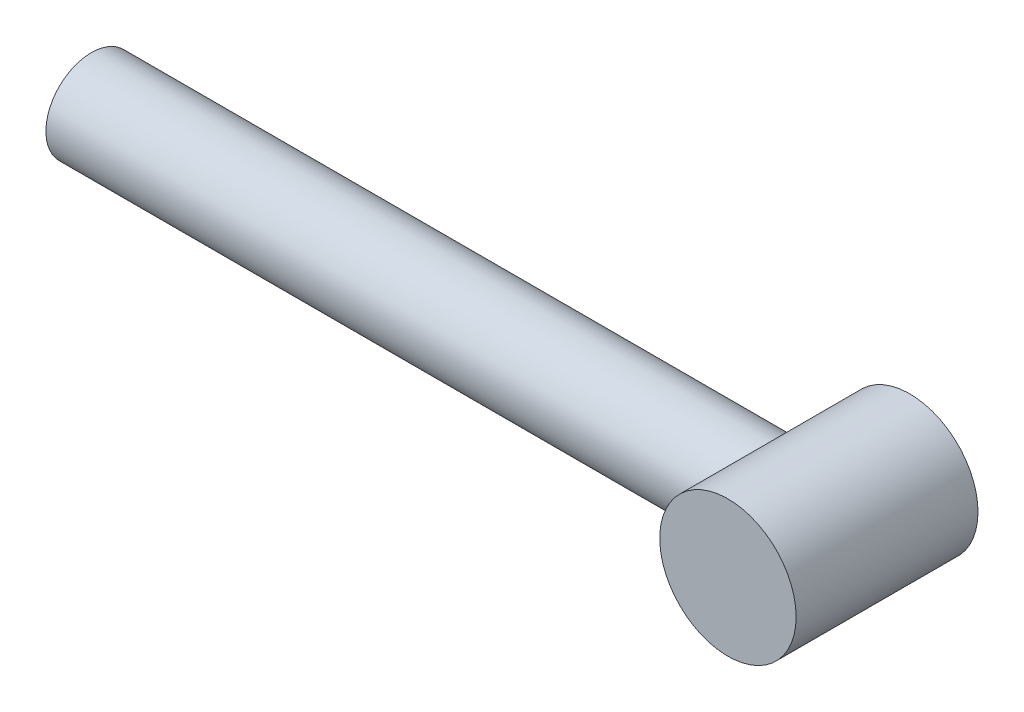
ISO-10303-21;
HEADER;
FILE_DESCRIPTION(('STEP AP214'),'2;1');
FILE_NAME('part.step','',(''),(''),'','','');
FILE_SCHEMA(('AUTOMOTIVE_DESIGN { 1 0 10303 214 1 1 1 1 }'));
ENDSEC;
DATA;
#1=APPLICATION_CONTEXT('core data for automotive mechanical design processes');
#2=APPLICATION_PROTOCOL_DEFINITION('international standard','automotive_design',2000,#1);
#3=PRODUCT_CONTEXT('',#1,'mechanical');
#4=PRODUCT('Part','Part','',(#3));
#5=PRODUCT_RELATED_PRODUCT_CATEGORY('part','',(#4));
#6=PRODUCT_DEFINITION_FORMATION('','',#4);
#7=PRODUCT_DEFINITION_CONTEXT('part definition',#1,'design');
#8=PRODUCT_DEFINITION('design','',#6,#7);
#9=PRODUCT_DEFINITION_SHAPE('','',#8);
#10=(LENGTH_UNIT() NAMED_UNIT(*) SI_UNIT(.MILLI.,.METRE.));
#11=(NAMED_UNIT(*) PLANE_ANGLE_UNIT() SI_UNIT($,.RADIAN.));
#12=(NAMED_UNIT(*) SI_UNIT($,.STERADIAN.) SOLID_ANGLE_UNIT());
#13=UNCERTAINTY_MEASURE_WITH_UNIT(LENGTH_MEASURE(1.E-05),#10,'distance_accuracy_value','');
#14=(GEOMETRIC_REPRESENTATION_CONTEXT(3) GLOBAL_UNCERTAINTY_ASSIGNED_CONTEXT((#13)) GLOBAL_UNIT_ASSIGNED_CONTEXT((#10,
#11,#12)) REPRESENTATION_CONTEXT('',''));
#15=CARTESIAN_POINT('',(0.,0.,0.));
#16=DIRECTION('',(0.,0.,1.));
#17=DIRECTION('',(1.,0.,0.));
#18=AXIS2_PLACEMENT_3D('',#15,#16,#17);
#19=CARTESIAN_POINT('',(0.,0.,3.175));
#20=DIRECTION('',(0.,0.,-1.));
#21=DIRECTION('',(-1.,0.,0.));
#22=AXIS2_PLACEMENT_3D('',#19,#20,#21);
#23=CYLINDRICAL_SURFACE('',#22,2.38125);
#24=CARTESIAN_POINT('',(-2.38125,0.,1.5875));
#25=CARTESIAN_POINT('',(-2.38125033055591,-0.0797597438552867,1.58750043627078));
#26=CARTESIAN_POINT('',(-2.37720824685502,-0.15951921291174,1.58145641134782));
#27=CARTESIAN_POINT('',(-2.36144317861398,-0.316494364812647,1.55765748911613));
#28=CARTESIAN_POINT('',(-2.34971654755105,-0.393708821701787,1.53989703202088));
#29=CARTESIAN_POINT('',(-2.31973820408737,-0.54309351935931,1.49375199937341));
#30=CARTESIAN_POINT('',(-2.30151706235319,-0.615285530171934,1.4654171701187));
#31=CARTESIAN_POINT('',(-2.26001371940218,-0.753598387229075,1.39933095540325));
#32=CARTESIAN_POINT('',(-2.23673078343123,-0.819718350090174,1.36157820274893));
#33=CARTESIAN_POINT('',(-2.18461692687309,-0.950344731236274,1.2742410559646));
#34=CARTESIAN_POINT('',(-2.15548287453585,-1.01423811745941,1.22392451053533));
#35=CARTESIAN_POINT('',(-2.09535961010001,-1.13325913547486,1.11463927387736));
#36=CARTESIAN_POINT('',(-2.06436777845735,-1.18837396900461,1.05565818694129));
#37=CARTESIAN_POINT('',(-1.99809310088793,-1.29716448835487,0.919914683207441));
#38=CARTESIAN_POINT('',(-1.96290460175628,-1.34924154175434,0.841815012769766));
#39=CARTESIAN_POINT('',(-1.89773041961298,-1.4394684588,0.675986568993059));
#40=CARTESIAN_POINT('',(-1.86773578664006,-1.47764240782283,0.588274793759543));
#41=CARTESIAN_POINT('',(-1.82543661646667,-1.52935015290331,0.431235410846607));
#42=CARTESIAN_POINT('',(-1.81052492139621,-1.54681592493588,0.363911790531406));
#43=CARTESIAN_POINT('',(-1.78798513417285,-1.57282052867018,0.226421549361249));
#44=CARTESIAN_POINT('',(-1.78034448940571,-1.58137474754971,0.156260046948436));
#45=CARTESIAN_POINT('',(-1.77352805701482,-1.58901895287124,0.0147043942829339));
#46=CARTESIAN_POINT('',(-1.77438687031172,-1.58807025315877,-0.0566936123643867));
#47=CARTESIAN_POINT('',(-1.78450696789608,-1.57668580183258,-0.198147760216386));
#48=CARTESIAN_POINT('',(-1.79377537076364,-1.56624201276591,-0.2682027132384));
#49=CARTESIAN_POINT('',(-1.81869703880818,-1.53721589160333,-0.402008221919831));
#50=CARTESIAN_POINT('',(-1.8340505636218,-1.51901295988044,-0.465900560388921));
#51=CARTESIAN_POINT('',(-1.86935763198854,-1.47534406624383,-0.589775054724507));
#52=CARTESIAN_POINT('',(-1.88931268879766,-1.44987571437529,-0.649755915923451));
#53=CARTESIAN_POINT('',(-1.93646580896011,-1.38647343624608,-0.77710140750531));
#54=CARTESIAN_POINT('',(-1.96431152292655,-1.3470576653596,-0.843486295774318));
#55=CARTESIAN_POINT('',(-2.02161408164442,-1.25943487370924,-0.969473069768398));
#56=CARTESIAN_POINT('',(-2.05107288176378,-1.21121701025154,-1.02906644077894));
#57=CARTESIAN_POINT('',(-2.11568779081077,-1.09522549966354,-1.15295564565821));
#58=CARTESIAN_POINT('',(-2.15070328613601,-1.02547688510464,-1.21549640116468));
#59=CARTESIAN_POINT('',(-2.21629367411347,-0.874718849291673,-1.32809971751721));
#60=CARTESIAN_POINT('',(-2.2468727101014,-0.793720075109322,-1.37817395291291));
#61=CARTESIAN_POINT('',(-2.29509164495113,-0.638855900253642,-1.4553229391613));
#62=CARTESIAN_POINT('',(-2.31409288549715,-0.566703879425322,-1.48498191965146));
#63=CARTESIAN_POINT('',(-2.3455925198089,-0.417541109874921,-1.53360828471396));
#64=CARTESIAN_POINT('',(-2.35809640876353,-0.340534528957865,-1.55258470528588));
#65=CARTESIAN_POINT('',(-2.3755023146185,-0.183344703455194,-1.57889667490798));
#66=CARTESIAN_POINT('',(-2.38037149703536,-0.103149250722658,-1.58618194711983));
#67=CARTESIAN_POINT('',(-2.38190972503616,0.0575004560152105,-1.58848987654617));
#68=CARTESIAN_POINT('',(-2.37857934387355,0.137954691535611,-1.58351339101294));
#69=CARTESIAN_POINT('',(-2.36457799105509,0.290874225530882,-1.56239840589772));
#70=CARTESIAN_POINT('',(-2.3544390807224,0.363503721714113,-1.5470685199068));
#71=CARTESIAN_POINT('',(-2.32821519119841,0.504917386489242,-1.50685842422729));
#72=CARTESIAN_POINT('',(-2.31212926374173,0.573700939822084,-1.48197669145073));
#73=CARTESIAN_POINT('',(-2.27406479820018,0.710140145682384,-1.4218822392206));
#74=CARTESIAN_POINT('',(-2.25178834420279,0.777475096551188,-1.38613502769753));
#75=CARTESIAN_POINT('',(-2.20346472891637,0.905417150266098,-1.30616857610515));
#76=CARTESIAN_POINT('',(-2.17741524133128,0.966020061384469,-1.26194410382759));
#77=CARTESIAN_POINT('',(-2.1189517140616,1.08890947351594,-1.15839250464998));
#78=CARTESIAN_POINT('',(-2.08618261960131,1.14994680133342,-1.0977830310654));
#79=CARTESIAN_POINT('',(-2.02065868636979,1.26153837155125,-0.96749280247154));
#80=CARTESIAN_POINT('',(-1.98790387294164,1.31208536840426,-0.897805831458418));
#81=CARTESIAN_POINT('',(-1.92833370182898,1.39799041386017,-0.756330709865302));
#82=CARTESIAN_POINT('',(-1.9012503013915,1.43427161174443,-0.685218948439372));
#83=CARTESIAN_POINT('',(-1.8529218582376,1.49618869656335,-0.536676082122867));
#84=CARTESIAN_POINT('',(-1.83166633070546,1.52184374385238,-0.459256655220705));
#85=CARTESIAN_POINT('',(-1.80128233994965,1.55762200750613,-0.313876938288642));
#86=CARTESIAN_POINT('',(-1.79066029679373,1.56970886818191,-0.246719875910917));
#87=CARTESIAN_POINT('',(-1.77704326485478,1.58511244701677,-0.110669957953533));
#88=CARTESIAN_POINT('',(-1.77403999194829,1.5884386910147,-0.0417790700330258));
#89=CARTESIAN_POINT('',(-1.77612834662798,1.5861023807263,0.095760426274434));
#90=CARTESIAN_POINT('',(-1.78122476739049,1.58043450396928,0.164408867090418));
#91=CARTESIAN_POINT('',(-1.79872046595271,1.56048866547142,0.299516425772366));
#92=CARTESIAN_POINT('',(-1.81112948612544,1.54619921684304,0.365972497848057));
#93=CARTESIAN_POINT('',(-1.84568182349436,1.50489472053136,0.512533254269478));
#94=CARTESIAN_POINT('',(-1.86953789775142,1.47550336035045,0.591556247148763));
#95=CARTESIAN_POINT('',(-1.92263840390039,1.405608427,0.742542674792462));
#96=CARTESIAN_POINT('',(-1.95189038188818,1.36508925245875,0.814496004030902));
#97=CARTESIAN_POINT('',(-2.01308641845588,1.27316135190652,0.951929997914382));
#98=CARTESIAN_POINT('',(-2.04506978742622,1.22156783478379,1.01726900417954));
#99=CARTESIAN_POINT('',(-2.10842464345663,1.10864465874681,1.13928721711723));
#100=CARTESIAN_POINT('',(-2.13979593973214,1.04731201689188,1.19596376014193));
#101=CARTESIAN_POINT('',(-2.2037004437149,0.906031755504732,1.30707773279533));
#102=CARTESIAN_POINT('',(-2.2357540807593,0.824675825209875,1.36002604564154));
#103=CARTESIAN_POINT('',(-2.29217272287615,0.651564416143403,1.45090616335308));
#104=CARTESIAN_POINT('',(-2.31654979797171,0.559825574569019,1.48886156604151));
#105=CARTESIAN_POINT('',(-2.35030680589286,0.390076586682124,1.5407914464175));
#106=CARTESIAN_POINT('',(-2.36181487542842,0.313541033173476,1.55821938728453));
#107=CARTESIAN_POINT('',(-2.37728347362596,0.158002297044008,1.58156912582711));
#108=CARTESIAN_POINT('',(-2.38124967258856,0.0790010137242316,1.58749956787933));
#109=CARTESIAN_POINT('',(-2.38125,0.,1.5875));
#110=B_SPLINE_CURVE_WITH_KNOTS('',3,(#24,#25,#26,#27,#28,#29,#30,#31,#32,#33,#34,#35,#36,#37,
#38,#39,#40,#41,#42,#43,#44,#45,#46,#47,#48,#49,#50,#51,#52,#53,#54,#55,#56,#57,#58,#59,#60,#61,
#62,#63,#64,#65,#66,#67,#68,#69,#70,#71,#72,#73,#74,#75,#76,#77,#78,#79,#80,#81,#82,#83,#84,#85,
#86,#87,#88,#89,#90,#91,#92,#93,#94,#95,#96,#97,#98,#99,#100,#101,#102,#103,#104,#105,#106,#107,
#108,#109),.UNSPECIFIED.,.T.,.F.,(4,2,2,2,2,2,2,2,2,2,2,2,2,2,2,2,2,2,2,2,2,2,2,2,2,2,2,2,2,2,2,
2,2,2,2,2,2,2,2,2,2,2,4),(0.,0.238960998538661,0.478035472639271,0.715999134094746,
0.95399736069738,1.21219141769192,1.47075851710928,1.77011554866186,2.06895148697317,
2.28150494355348,2.49369078227611,2.70674077439956,2.91997127827786,3.1237940936968,
3.32768403395281,3.57304637386052,3.81871302374125,4.11733170130502,4.41566966987911,
4.65553494608006,4.89519702268312,5.13588701113516,5.37656017278352,5.60032761052729,
5.82413074389707,6.06149050294633,6.2989972361146,6.57406114810854,6.84931441581962,
7.10128386146632,7.35279697394778,7.55907213111511,7.76512290263095,7.97129565474563,
8.17774370806547,8.43920245657657,8.70102966242455,8.96762275879763,9.23429766650012,
9.53925060298524,9.84372163331359,10.0805876252106,10.3172754606099),.UNSPECIFIED.);
#111=CARTESIAN_POINT('',(-2.38125,0.,1.5875));
#112=VERTEX_POINT('',#111);
#113=EDGE_CURVE('E34',#112,#112,#110,.T.);
#114=ORIENTED_EDGE('',*,*,#113,.T.);
#115=EDGE_LOOP('',(#114));
#116=FACE_BOUND('',#115,.T.);
#117=CARTESIAN_POINT('',(0.,0.,3.175));
#118=DIRECTION('',(0.,0.,1.));
#119=DIRECTION('',(1.,0.,0.));
#120=AXIS2_PLACEMENT_3D('',#117,#118,#119);
#121=CIRCLE('',#120,2.38125);
#122=CARTESIAN_POINT('',(2.38125,0.,3.175));
#123=VERTEX_POINT('',#122);
#124=EDGE_CURVE('E10',#123,#123,#121,.T.);
#125=ORIENTED_EDGE('',*,*,#124,.F.);
#126=EDGE_LOOP('',(#125));
#127=FACE_BOUND('',#126,.T.);
#128=CARTESIAN_POINT('',(0.,0.,-3.175));
#129=DIRECTION('',(0.,0.,1.));
#130=DIRECTION('',(1.,0.,0.));
#131=AXIS2_PLACEMENT_3D('',#128,#129,#130);
#132=CIRCLE('',#131,2.38125);
#133=CARTESIAN_POINT('',(2.38125,0.,-3.175));
#134=VERTEX_POINT('',#133);
#135=EDGE_CURVE('E42',#134,#134,#132,.T.);
#136=ORIENTED_EDGE('',*,*,#135,.T.);
#137=EDGE_LOOP('',(#136));
#138=FACE_BOUND('',#137,.T.);
#139=ADVANCED_FACE('F30',(#116,#127,#138),#23,.T.);
#140=CARTESIAN_POINT('',(0.,0.,3.175));
#141=DIRECTION('',(0.,0.,1.));
#142=DIRECTION('',(1.,0.,0.));
#143=AXIS2_PLACEMENT_3D('',#140,#141,#142);
#144=PLANE('',#143);
#145=ORIENTED_EDGE('',*,*,#124,.T.);
#146=EDGE_LOOP('',(#145));
#147=FACE_BOUND('',#146,.T.);
#148=ADVANCED_FACE('F67',(#147),#144,.T.);
#149=CARTESIAN_POINT('',(0.,0.,-3.175));
#150=DIRECTION('',(0.,0.,1.));
#151=DIRECTION('',(1.,0.,0.));
#152=AXIS2_PLACEMENT_3D('',#149,#150,#151);
#153=PLANE('',#152);
#154=ORIENTED_EDGE('',*,*,#135,.F.);
#155=EDGE_LOOP('',(#154));
#156=FACE_BOUND('',#155,.T.);
#157=ADVANCED_FACE('F60',(#156),#153,.F.);
#158=CARTESIAN_POINT('',(-25.4,0.,0.));
#159=DIRECTION('',(1.,0.,0.));
#160=DIRECTION('',(0.,0.,-1.));
#161=AXIS2_PLACEMENT_3D('',#158,#159,#160);
#162=CYLINDRICAL_SURFACE('',#161,1.5875);
#163=CARTESIAN_POINT('',(-25.4,0.,0.));
#164=DIRECTION('',(1.,0.,0.));
#165=DIRECTION('',(0.,0.,-1.));
#166=AXIS2_PLACEMENT_3D('',#163,#164,#165);
#167=CIRCLE('',#166,1.5875);
#168=CARTESIAN_POINT('',(-25.4,0.,-1.5875));
#169=VERTEX_POINT('',#168);
#170=EDGE_CURVE('E48',#169,#169,#167,.T.);
#171=ORIENTED_EDGE('',*,*,#170,.T.);
#172=EDGE_LOOP('',(#171));
#173=FACE_BOUND('',#172,.T.);
#174=ORIENTED_EDGE('',*,*,#113,.F.);
#175=EDGE_LOOP('',(#174));
#176=FACE_BOUND('',#175,.T.);
#177=ADVANCED_FACE('F57',(#173,#176),#162,.T.);
#178=CARTESIAN_POINT('',(-25.4,0.,0.));
#179=DIRECTION('',(1.,0.,0.));
#180=DIRECTION('',(0.,0.,-1.));
#181=AXIS2_PLACEMENT_3D('',#178,#179,#180);
#182=PLANE('',#181);
#183=ORIENTED_EDGE('',*,*,#170,.F.);
#184=EDGE_LOOP('',(#183));
#185=FACE_BOUND('',#184,.T.);
#186=ADVANCED_FACE('F59',(#185),#182,.F.);
#187=CLOSED_SHELL('',(#139,#148,#157,#177,#186));
#188=MANIFOLD_SOLID_BREP('B2',#187);
#189=ADVANCED_BREP_SHAPE_REPRESENTATION('',(#18,#188),#14);
#190=SHAPE_DEFINITION_REPRESENTATION(#9,#189);
ENDSEC;
END-ISO-10303-21;
